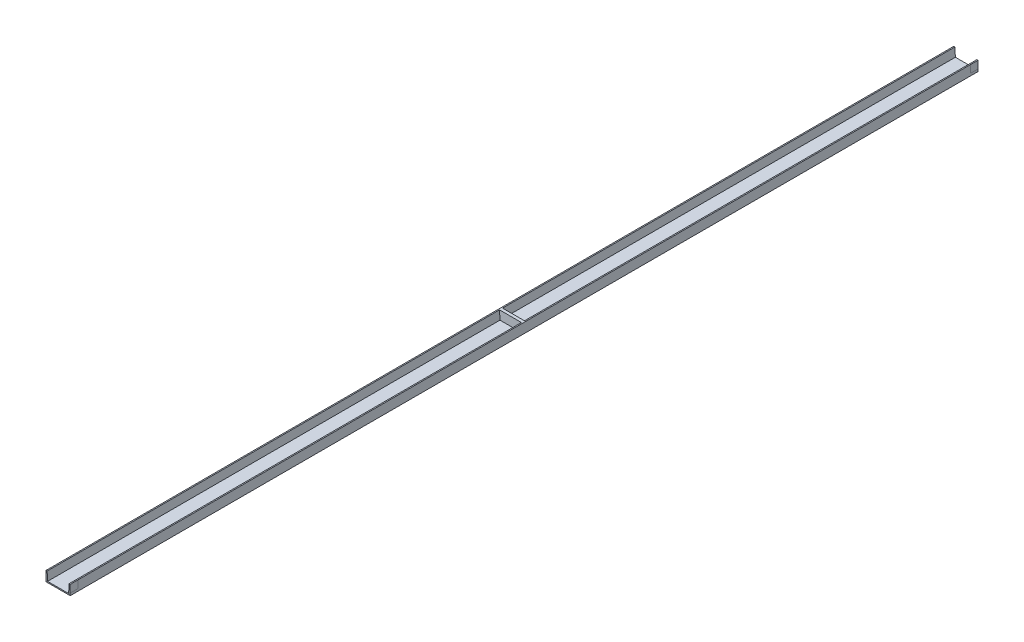
ISO-10303-21;
HEADER;
FILE_DESCRIPTION(('STEP AP214'),'2;1');
FILE_NAME('part.step','',(''),(''),'','','');
FILE_SCHEMA(('AUTOMOTIVE_DESIGN { 1 0 10303 214 1 1 1 1 }'));
ENDSEC;
DATA;
#1=APPLICATION_CONTEXT('core data for automotive mechanical design processes');
#2=APPLICATION_PROTOCOL_DEFINITION('international standard','automotive_design',2000,#1);
#3=PRODUCT_CONTEXT('',#1,'mechanical');
#4=PRODUCT('Part','Part','',(#3));
#5=PRODUCT_RELATED_PRODUCT_CATEGORY('part','',(#4));
#6=PRODUCT_DEFINITION_FORMATION('','',#4);
#7=PRODUCT_DEFINITION_CONTEXT('part definition',#1,'design');
#8=PRODUCT_DEFINITION('design','',#6,#7);
#9=PRODUCT_DEFINITION_SHAPE('','',#8);
#10=(LENGTH_UNIT() NAMED_UNIT(*) SI_UNIT(.MILLI.,.METRE.));
#11=(NAMED_UNIT(*) PLANE_ANGLE_UNIT() SI_UNIT($,.RADIAN.));
#12=(NAMED_UNIT(*) SI_UNIT($,.STERADIAN.) SOLID_ANGLE_UNIT());
#13=UNCERTAINTY_MEASURE_WITH_UNIT(LENGTH_MEASURE(1.E-05),#10,'distance_accuracy_value','');
#14=(GEOMETRIC_REPRESENTATION_CONTEXT(3) GLOBAL_UNCERTAINTY_ASSIGNED_CONTEXT((#13)) GLOBAL_UNIT_ASSIGNED_CONTEXT((#10,
#11,#12)) REPRESENTATION_CONTEXT('',''));
#15=CARTESIAN_POINT('',(0.,0.,0.));
#16=DIRECTION('',(0.,0.,1.));
#17=DIRECTION('',(1.,0.,0.));
#18=AXIS2_PLACEMENT_3D('',#15,#16,#17);
#19=CARTESIAN_POINT('',(80.,65.,3000.));
#20=DIRECTION('',(-1.,0.,0.));
#21=DIRECTION('',(0.,-1.,0.));
#22=AXIS2_PLACEMENT_3D('',#19,#20,#21);
#23=PLANE('',#22);
#24=DIRECTION('',(0.,-1.,0.));
#25=VECTOR('',#24,1.);
#26=CARTESIAN_POINT('',(80.,65.,-2950.));
#27=LINE('',#26,#25);
#28=CARTESIAN_POINT('',(80.,65.,-2950.));
#29=VERTEX_POINT('',#28);
#30=CARTESIAN_POINT('',(80.,15.,-2950.));
#31=VERTEX_POINT('',#30);
#32=EDGE_CURVE('E11',#29,#31,#27,.T.);
#33=ORIENTED_EDGE('',*,*,#32,.F.);
#34=DIRECTION('',(0.,0.,-1.));
#35=VECTOR('',#34,1.);
#36=CARTESIAN_POINT('',(80.,65.,3000.));
#37=LINE('',#36,#35);
#38=CARTESIAN_POINT('',(80.,65.,2950.));
#39=VERTEX_POINT('',#38);
#40=EDGE_CURVE('E193',#39,#29,#37,.T.);
#41=ORIENTED_EDGE('',*,*,#40,.F.);
#42=DIRECTION('',(0.,1.,0.));
#43=VECTOR('',#42,1.);
#44=CARTESIAN_POINT('',(80.,65.,2950.));
#45=LINE('',#44,#43);
#46=CARTESIAN_POINT('',(80.,15.,2950.));
#47=VERTEX_POINT('',#46);
#48=EDGE_CURVE('E199',#47,#39,#45,.T.);
#49=ORIENTED_EDGE('',*,*,#48,.F.);
#50=DIRECTION('',(0.,0.,-1.));
#51=VECTOR('',#50,1.);
#52=CARTESIAN_POINT('',(80.,15.,3000.));
#53=LINE('',#52,#51);
#54=CARTESIAN_POINT('',(80.,15.,3000.));
#55=VERTEX_POINT('',#54);
#56=EDGE_CURVE('E202',#55,#47,#53,.T.);
#57=ORIENTED_EDGE('',*,*,#56,.F.);
#58=DIRECTION('',(0.,1.,0.));
#59=VECTOR('',#58,1.);
#60=CARTESIAN_POINT('',(80.,65.,3000.));
#61=LINE('',#60,#59);
#62=CARTESIAN_POINT('',(80.,0.,3000.));
#63=VERTEX_POINT('',#62);
#64=EDGE_CURVE('E252',#63,#55,#61,.T.);
#65=ORIENTED_EDGE('',*,*,#64,.F.);
#66=DIRECTION('',(0.,0.,-1.));
#67=VECTOR('',#66,1.);
#68=CARTESIAN_POINT('',(80.,0.,3000.));
#69=LINE('',#68,#67);
#70=CARTESIAN_POINT('',(80.,0.,-3000.));
#71=VERTEX_POINT('',#70);
#72=EDGE_CURVE('E192',#63,#71,#69,.T.);
#73=ORIENTED_EDGE('',*,*,#72,.T.);
#74=DIRECTION('',(0.,1.,0.));
#75=VECTOR('',#74,1.);
#76=CARTESIAN_POINT('',(80.,65.,-3000.));
#77=LINE('',#76,#75);
#78=CARTESIAN_POINT('',(80.,15.,-3000.));
#79=VERTEX_POINT('',#78);
#80=EDGE_CURVE('E217',#71,#79,#77,.T.);
#81=ORIENTED_EDGE('',*,*,#80,.T.);
#82=DIRECTION('',(0.,0.,-1.));
#83=VECTOR('',#82,1.);
#84=CARTESIAN_POINT('',(80.,14.9999999999992,3000.));
#85=LINE('',#84,#83);
#86=EDGE_CURVE('E52',#31,#79,#85,.T.);
#87=ORIENTED_EDGE('',*,*,#86,.F.);
#88=EDGE_LOOP('',(#33,#41,#49,#57,#65,#73,#81,#87));
#89=FACE_BOUND('',#88,.T.);
#90=ADVANCED_FACE('F43',(#89),#23,.F.);
#91=CARTESIAN_POINT('',(80.,65.,-3000.));
#92=VERTEX_POINT('',#91);
#93=EDGE_CURVE('E188',#29,#92,#37,.T.);
#94=ORIENTED_EDGE('',*,*,#93,.F.);
#95=ORIENTED_EDGE('',*,*,#32,.T.);
#96=ORIENTED_EDGE('',*,*,#86,.T.);
#97=EDGE_CURVE('E210',#79,#92,#77,.T.);
#98=ORIENTED_EDGE('',*,*,#97,.T.);
#99=EDGE_LOOP('',(#94,#95,#96,#98));
#100=FACE_BOUND('',#99,.T.);
#101=ADVANCED_FACE('F209',(#100),#23,.F.);
#102=CARTESIAN_POINT('',(69.5,7.49999999999998,3000.));
#103=DIRECTION('',(0.99864171383128,-0.0521030459390228,0.));
#104=DIRECTION('',(0.0521030459390228,0.99864171383128,0.));
#105=AXIS2_PLACEMENT_3D('',#102,#103,#104);
#106=PLANE('',#105);
#107=DIRECTION('',(0.0521030459390228,0.99864171383128,0.));
#108=VECTOR('',#107,1.);
#109=CARTESIAN_POINT('',(72.5,65.,10.));
#110=LINE('',#109,#108);
#111=CARTESIAN_POINT('',(69.5,7.49999999999998,10.));
#112=VERTEX_POINT('',#111);
#113=CARTESIAN_POINT('',(72.5,65.,10.));
#114=VERTEX_POINT('',#113);
#115=EDGE_CURVE('E152',#112,#114,#110,.T.);
#116=ORIENTED_EDGE('',*,*,#115,.F.);
#117=DIRECTION('',(0.,0.,-1.));
#118=VECTOR('',#117,1.);
#119=CARTESIAN_POINT('',(69.5,7.49999999999998,3000.));
#120=LINE('',#119,#118);
#121=CARTESIAN_POINT('',(69.5,7.49999999999998,3000.));
#122=VERTEX_POINT('',#121);
#123=EDGE_CURVE('E182',#122,#112,#120,.T.);
#124=ORIENTED_EDGE('',*,*,#123,.F.);
#125=DIRECTION('',(-0.0521030459390228,-0.99864171383128,0.));
#126=VECTOR('',#125,1.);
#127=CARTESIAN_POINT('',(69.5,7.49999999999998,3000.));
#128=LINE('',#127,#126);
#129=CARTESIAN_POINT('',(72.5,65.,3000.));
#130=VERTEX_POINT('',#129);
#131=EDGE_CURVE('E257',#130,#122,#128,.T.);
#132=ORIENTED_EDGE('',*,*,#131,.F.);
#133=DIRECTION('',(0.,0.,-1.));
#134=VECTOR('',#133,1.);
#135=CARTESIAN_POINT('',(72.5,65.,3000.));
#136=LINE('',#135,#134);
#137=EDGE_CURVE('E186',#130,#114,#136,.T.);
#138=ORIENTED_EDGE('',*,*,#137,.T.);
#139=EDGE_LOOP('',(#116,#124,#132,#138));
#140=FACE_BOUND('',#139,.T.);
#141=ADVANCED_FACE('F305',(#140),#106,.F.);
#142=CARTESIAN_POINT('',(-69.5,7.49999999999998,3000.));
#143=DIRECTION('',(0.,-1.,0.));
#144=DIRECTION('',(1.,0.,0.));
#145=AXIS2_PLACEMENT_3D('',#142,#143,#144);
#146=PLANE('',#145);
#147=DIRECTION('',(1.,0.,0.));
#148=VECTOR('',#147,1.);
#149=CARTESIAN_POINT('',(69.5,7.49999999999998,10.));
#150=LINE('',#149,#148);
#151=CARTESIAN_POINT('',(-69.5,7.49999999999998,10.));
#152=VERTEX_POINT('',#151);
#153=EDGE_CURVE('E168',#152,#112,#150,.T.);
#154=ORIENTED_EDGE('',*,*,#153,.F.);
#155=DIRECTION('',(0.,0.,-1.));
#156=VECTOR('',#155,1.);
#157=CARTESIAN_POINT('',(-69.5,7.49999999999998,3000.));
#158=LINE('',#157,#156);
#159=CARTESIAN_POINT('',(-69.5,7.49999999999998,3000.));
#160=VERTEX_POINT('',#159);
#161=EDGE_CURVE('E167',#160,#152,#158,.T.);
#162=ORIENTED_EDGE('',*,*,#161,.F.);
#163=DIRECTION('',(-1.,0.,0.));
#164=VECTOR('',#163,1.);
#165=CARTESIAN_POINT('',(-69.5,7.49999999999998,3000.));
#166=LINE('',#165,#164);
#167=EDGE_CURVE('E259',#122,#160,#166,.T.);
#168=ORIENTED_EDGE('',*,*,#167,.F.);
#169=ORIENTED_EDGE('',*,*,#123,.T.);
#170=EDGE_LOOP('',(#154,#162,#168,#169));
#171=FACE_BOUND('',#170,.T.);
#172=ADVANCED_FACE('F325',(#171),#146,.F.);
#173=CARTESIAN_POINT('',(-72.5,65.,3000.));
#174=DIRECTION('',(-0.99864171383128,-0.0521030459390229,0.));
#175=DIRECTION('',(0.0521030459390229,-0.99864171383128,0.));
#176=AXIS2_PLACEMENT_3D('',#173,#174,#175);
#177=PLANE('',#176);
#178=DIRECTION('',(0.0521030459390229,-0.99864171383128,0.));
#179=VECTOR('',#178,1.);
#180=CARTESIAN_POINT('',(-69.5,7.49999999999998,10.));
#181=LINE('',#180,#179);
#182=CARTESIAN_POINT('',(-72.5,65.,10.));
#183=VERTEX_POINT('',#182);
#184=EDGE_CURVE('E149',#183,#152,#181,.T.);
#185=ORIENTED_EDGE('',*,*,#184,.F.);
#186=DIRECTION('',(0.,0.,-1.));
#187=VECTOR('',#186,1.);
#188=CARTESIAN_POINT('',(-72.5,65.,3000.));
#189=LINE('',#188,#187);
#190=CARTESIAN_POINT('',(-72.5,65.,3000.));
#191=VERTEX_POINT('',#190);
#192=EDGE_CURVE('E164',#191,#183,#189,.T.);
#193=ORIENTED_EDGE('',*,*,#192,.F.);
#194=DIRECTION('',(-0.0521030459390229,0.99864171383128,0.));
#195=VECTOR('',#194,1.);
#196=CARTESIAN_POINT('',(-72.5,65.,3000.));
#197=LINE('',#196,#195);
#198=EDGE_CURVE('E261',#160,#191,#197,.T.);
#199=ORIENTED_EDGE('',*,*,#198,.F.);
#200=ORIENTED_EDGE('',*,*,#161,.T.);
#201=EDGE_LOOP('',(#185,#193,#199,#200));
#202=FACE_BOUND('',#201,.T.);
#203=ADVANCED_FACE('F162',(#202),#177,.F.);
#204=CARTESIAN_POINT('',(-80.,0.,3000.));
#205=DIRECTION('',(1.,0.,0.));
#206=DIRECTION('',(0.,1.,0.));
#207=AXIS2_PLACEMENT_3D('',#204,#205,#206);
#208=PLANE('',#207);
#209=DIRECTION('',(0.,-1.,0.));
#210=VECTOR('',#209,1.);
#211=CARTESIAN_POINT('',(-80.,0.,-3000.));
#212=LINE('',#211,#210);
#213=CARTESIAN_POINT('',(-80.,65.,-3000.));
#214=VERTEX_POINT('',#213);
#215=CARTESIAN_POINT('',(-80.,0.,-3000.));
#216=VERTEX_POINT('',#215);
#217=EDGE_CURVE('E263',#214,#216,#212,.T.);
#218=ORIENTED_EDGE('',*,*,#217,.T.);
#219=DIRECTION('',(0.,0.,-1.));
#220=VECTOR('',#219,1.);
#221=CARTESIAN_POINT('',(-80.,0.,3000.));
#222=LINE('',#221,#220);
#223=CARTESIAN_POINT('',(-80.,0.,3000.));
#224=VERTEX_POINT('',#223);
#225=EDGE_CURVE('E196',#224,#216,#222,.T.);
#226=ORIENTED_EDGE('',*,*,#225,.F.);
#227=DIRECTION('',(0.,-1.,0.));
#228=VECTOR('',#227,1.);
#229=CARTESIAN_POINT('',(-80.,0.,3000.));
#230=LINE('',#229,#228);
#231=CARTESIAN_POINT('',(-80.,65.,3000.));
#232=VERTEX_POINT('',#231);
#233=EDGE_CURVE('E238',#232,#224,#230,.T.);
#234=ORIENTED_EDGE('',*,*,#233,.F.);
#235=DIRECTION('',(0.,0.,-1.));
#236=VECTOR('',#235,1.);
#237=CARTESIAN_POINT('',(-80.,65.,3000.));
#238=LINE('',#237,#236);
#239=EDGE_CURVE('E177',#232,#214,#238,.T.);
#240=ORIENTED_EDGE('',*,*,#239,.T.);
#241=EDGE_LOOP('',(#218,#226,#234,#240));
#242=FACE_BOUND('',#241,.T.);
#243=ADVANCED_FACE('F45',(#242),#208,.F.);
#244=CARTESIAN_POINT('',(80.,0.,3000.));
#245=DIRECTION('',(0.,1.,0.));
#246=DIRECTION('',(0.,0.,1.));
#247=AXIS2_PLACEMENT_3D('',#244,#245,#246);
#248=PLANE('',#247);
#249=DIRECTION('',(1.,0.,0.));
#250=VECTOR('',#249,1.);
#251=CARTESIAN_POINT('',(80.,0.,-3000.));
#252=LINE('',#251,#250);
#253=EDGE_CURVE('E221',#216,#71,#252,.T.);
#254=ORIENTED_EDGE('',*,*,#253,.T.);
#255=ORIENTED_EDGE('',*,*,#72,.F.);
#256=DIRECTION('',(1.,0.,0.));
#257=VECTOR('',#256,1.);
#258=CARTESIAN_POINT('',(80.,0.,3000.));
#259=LINE('',#258,#257);
#260=EDGE_CURVE('E242',#224,#63,#259,.T.);
#261=ORIENTED_EDGE('',*,*,#260,.F.);
#262=ORIENTED_EDGE('',*,*,#225,.T.);
#263=EDGE_LOOP('',(#254,#255,#261,#262));
#264=FACE_BOUND('',#263,.T.);
#265=ADVANCED_FACE('F308',(#264),#248,.F.);
#266=CARTESIAN_POINT('',(80.,65.,3000.));
#267=VERTEX_POINT('',#266);
#268=EDGE_CURVE('E247',#55,#267,#61,.T.);
#269=ORIENTED_EDGE('',*,*,#268,.F.);
#270=ORIENTED_EDGE('',*,*,#56,.T.);
#271=ORIENTED_EDGE('',*,*,#48,.T.);
#272=EDGE_CURVE('E189',#267,#39,#37,.T.);
#273=ORIENTED_EDGE('',*,*,#272,.F.);
#274=EDGE_LOOP('',(#269,#270,#271,#273));
#275=FACE_BOUND('',#274,.T.);
#276=ADVANCED_FACE('F301',(#275),#23,.F.);
#277=CARTESIAN_POINT('',(69.5,7.49999999999998,-10.));
#278=VERTEX_POINT('',#277);
#279=CARTESIAN_POINT('',(69.5,7.49999999999998,-3000.));
#280=VERTEX_POINT('',#279);
#281=EDGE_CURVE('E181',#278,#280,#120,.T.);
#282=ORIENTED_EDGE('',*,*,#281,.F.);
#283=DIRECTION('',(0.0521030459390228,0.99864171383128,0.));
#284=VECTOR('',#283,1.);
#285=CARTESIAN_POINT('',(72.5,65.,-10.));
#286=LINE('',#285,#284);
#287=CARTESIAN_POINT('',(72.5,65.,-10.));
#288=VERTEX_POINT('',#287);
#289=EDGE_CURVE('E157',#278,#288,#286,.T.);
#290=ORIENTED_EDGE('',*,*,#289,.T.);
#291=CARTESIAN_POINT('',(72.5,65.,-3000.));
#292=VERTEX_POINT('',#291);
#293=EDGE_CURVE('E185',#288,#292,#136,.T.);
#294=ORIENTED_EDGE('',*,*,#293,.T.);
#295=DIRECTION('',(-0.0521030459390228,-0.99864171383128,0.));
#296=VECTOR('',#295,1.);
#297=CARTESIAN_POINT('',(69.5,7.49999999999998,-3000.));
#298=LINE('',#297,#296);
#299=EDGE_CURVE('E225',#292,#280,#298,.T.);
#300=ORIENTED_EDGE('',*,*,#299,.T.);
#301=EDGE_LOOP('',(#282,#290,#294,#300));
#302=FACE_BOUND('',#301,.T.);
#303=ADVANCED_FACE('F281',(#302),#106,.F.);
#304=CARTESIAN_POINT('',(-69.5,7.49999999999998,-10.));
#305=VERTEX_POINT('',#304);
#306=CARTESIAN_POINT('',(-69.5,7.49999999999998,-3000.));
#307=VERTEX_POINT('',#306);
#308=EDGE_CURVE('E173',#305,#307,#158,.T.);
#309=ORIENTED_EDGE('',*,*,#308,.F.);
#310=DIRECTION('',(1.,0.,0.));
#311=VECTOR('',#310,1.);
#312=CARTESIAN_POINT('',(69.5,7.49999999999998,-10.));
#313=LINE('',#312,#311);
#314=EDGE_CURVE('E273',#305,#278,#313,.T.);
#315=ORIENTED_EDGE('',*,*,#314,.T.);
#316=ORIENTED_EDGE('',*,*,#281,.T.);
#317=DIRECTION('',(-1.,0.,0.));
#318=VECTOR('',#317,1.);
#319=CARTESIAN_POINT('',(-69.5,7.49999999999998,-3000.));
#320=LINE('',#319,#318);
#321=EDGE_CURVE('E232',#280,#307,#320,.T.);
#322=ORIENTED_EDGE('',*,*,#321,.T.);
#323=EDGE_LOOP('',(#309,#315,#316,#322));
#324=FACE_BOUND('',#323,.T.);
#325=ADVANCED_FACE('F287',(#324),#146,.F.);
#326=CARTESIAN_POINT('',(-72.5,65.,-9.99999999999979));
#327=VERTEX_POINT('',#326);
#328=CARTESIAN_POINT('',(-72.5,65.,-3000.));
#329=VERTEX_POINT('',#328);
#330=EDGE_CURVE('E174',#327,#329,#189,.T.);
#331=ORIENTED_EDGE('',*,*,#330,.F.);
#332=DIRECTION('',(0.0521030459390229,-0.99864171383128,0.));
#333=VECTOR('',#332,1.);
#334=CARTESIAN_POINT('',(-69.5,7.49999999999998,-10.));
#335=LINE('',#334,#333);
#336=EDGE_CURVE('E271',#327,#305,#335,.T.);
#337=ORIENTED_EDGE('',*,*,#336,.T.);
#338=ORIENTED_EDGE('',*,*,#308,.T.);
#339=DIRECTION('',(-0.0521030459390229,0.99864171383128,0.));
#340=VECTOR('',#339,1.);
#341=CARTESIAN_POINT('',(-72.5,65.,-3000.));
#342=LINE('',#341,#340);
#343=EDGE_CURVE('E235',#307,#329,#342,.T.);
#344=ORIENTED_EDGE('',*,*,#343,.T.);
#345=EDGE_LOOP('',(#331,#337,#338,#344));
#346=FACE_BOUND('',#345,.T.);
#347=ADVANCED_FACE('F290',(#346),#177,.F.);
#348=CARTESIAN_POINT('',(-80.,65.,3000.));
#349=DIRECTION('',(0.,-1.,0.));
#350=DIRECTION('',(1.,0.,0.));
#351=AXIS2_PLACEMENT_3D('',#348,#349,#350);
#352=PLANE('',#351);
#353=DIRECTION('',(-1.,0.,0.));
#354=VECTOR('',#353,1.);
#355=CARTESIAN_POINT('',(-80.,65.,-3000.));
#356=LINE('',#355,#354);
#357=EDGE_CURVE('E237',#329,#214,#356,.T.);
#358=ORIENTED_EDGE('',*,*,#357,.T.);
#359=ORIENTED_EDGE('',*,*,#239,.F.);
#360=DIRECTION('',(-1.,0.,0.));
#361=VECTOR('',#360,1.);
#362=CARTESIAN_POINT('',(-80.,65.,3000.));
#363=LINE('',#362,#361);
#364=EDGE_CURVE('E172',#191,#232,#363,.T.);
#365=ORIENTED_EDGE('',*,*,#364,.F.);
#366=ORIENTED_EDGE('',*,*,#192,.T.);
#367=DIRECTION('',(-1.,0.,0.));
#368=VECTOR('',#367,1.);
#369=CARTESIAN_POINT('',(-72.5,65.,10.));
#370=LINE('',#369,#368);
#371=EDGE_CURVE('E146',#114,#183,#370,.T.);
#372=ORIENTED_EDGE('',*,*,#371,.F.);
#373=ORIENTED_EDGE('',*,*,#137,.F.);
#374=DIRECTION('',(-1.,0.,0.));
#375=VECTOR('',#374,1.);
#376=CARTESIAN_POINT('',(72.5,65.,3000.));
#377=LINE('',#376,#375);
#378=EDGE_CURVE('E255',#267,#130,#377,.T.);
#379=ORIENTED_EDGE('',*,*,#378,.F.);
#380=ORIENTED_EDGE('',*,*,#272,.T.);
#381=ORIENTED_EDGE('',*,*,#40,.T.);
#382=ORIENTED_EDGE('',*,*,#93,.T.);
#383=DIRECTION('',(-1.,0.,0.));
#384=VECTOR('',#383,1.);
#385=CARTESIAN_POINT('',(72.5,65.,-3000.));
#386=LINE('',#385,#384);
#387=EDGE_CURVE('E220',#92,#292,#386,.T.);
#388=ORIENTED_EDGE('',*,*,#387,.T.);
#389=ORIENTED_EDGE('',*,*,#293,.F.);
#390=DIRECTION('',(-1.,0.,0.));
#391=VECTOR('',#390,1.);
#392=CARTESIAN_POINT('',(-72.5,65.,-10.));
#393=LINE('',#392,#391);
#394=EDGE_CURVE('E269',#288,#327,#393,.T.);
#395=ORIENTED_EDGE('',*,*,#394,.T.);
#396=ORIENTED_EDGE('',*,*,#330,.T.);
#397=EDGE_LOOP('',(#358,#359,#365,#366,#372,#373,#379,#380,#381,#382,#388,#389,#395,#396));
#398=FACE_BOUND('',#397,.T.);
#399=ADVANCED_FACE('F170',(#398),#352,.F.);
#400=CARTESIAN_POINT('',(0.,0.,3000.));
#401=DIRECTION('',(0.,0.,-1.));
#402=DIRECTION('',(-1.,0.,0.));
#403=AXIS2_PLACEMENT_3D('',#400,#401,#402);
#404=PLANE('',#403);
#405=ORIENTED_EDGE('',*,*,#233,.T.);
#406=ORIENTED_EDGE('',*,*,#260,.T.);
#407=ORIENTED_EDGE('',*,*,#64,.T.);
#408=ORIENTED_EDGE('',*,*,#268,.T.);
#409=ORIENTED_EDGE('',*,*,#378,.T.);
#410=ORIENTED_EDGE('',*,*,#131,.T.);
#411=ORIENTED_EDGE('',*,*,#167,.T.);
#412=ORIENTED_EDGE('',*,*,#198,.T.);
#413=ORIENTED_EDGE('',*,*,#364,.T.);
#414=EDGE_LOOP('',(#405,#406,#407,#408,#409,#410,#411,#412,#413));
#415=FACE_BOUND('',#414,.T.);
#416=ADVANCED_FACE('F319',(#415),#404,.F.);
#417=CARTESIAN_POINT('',(0.,0.,-3000.));
#418=DIRECTION('',(0.,0.,-1.));
#419=DIRECTION('',(-1.,0.,0.));
#420=AXIS2_PLACEMENT_3D('',#417,#418,#419);
#421=PLANE('',#420);
#422=ORIENTED_EDGE('',*,*,#217,.F.);
#423=ORIENTED_EDGE('',*,*,#357,.F.);
#424=ORIENTED_EDGE('',*,*,#343,.F.);
#425=ORIENTED_EDGE('',*,*,#321,.F.);
#426=ORIENTED_EDGE('',*,*,#299,.F.);
#427=ORIENTED_EDGE('',*,*,#387,.F.);
#428=ORIENTED_EDGE('',*,*,#97,.F.);
#429=ORIENTED_EDGE('',*,*,#80,.F.);
#430=ORIENTED_EDGE('',*,*,#253,.F.);
#431=EDGE_LOOP('',(#422,#423,#424,#425,#426,#427,#428,#429,#430));
#432=FACE_BOUND('',#431,.T.);
#433=ADVANCED_FACE('F216',(#432),#421,.T.);
#434=CARTESIAN_POINT('',(0.,0.,10.));
#435=DIRECTION('',(0.,0.,-1.));
#436=DIRECTION('',(-1.,0.,0.));
#437=AXIS2_PLACEMENT_3D('',#434,#435,#436);
#438=PLANE('',#437);
#439=ORIENTED_EDGE('',*,*,#371,.T.);
#440=ORIENTED_EDGE('',*,*,#184,.T.);
#441=ORIENTED_EDGE('',*,*,#153,.T.);
#442=ORIENTED_EDGE('',*,*,#115,.T.);
#443=EDGE_LOOP('',(#439,#440,#441,#442));
#444=FACE_BOUND('',#443,.T.);
#445=ADVANCED_FACE('F148',(#444),#438,.F.);
#446=CARTESIAN_POINT('',(0.,0.,-10.));
#447=DIRECTION('',(0.,0.,-1.));
#448=DIRECTION('',(-1.,0.,0.));
#449=AXIS2_PLACEMENT_3D('',#446,#447,#448);
#450=PLANE('',#449);
#451=ORIENTED_EDGE('',*,*,#394,.F.);
#452=ORIENTED_EDGE('',*,*,#289,.F.);
#453=ORIENTED_EDGE('',*,*,#314,.F.);
#454=ORIENTED_EDGE('',*,*,#336,.F.);
#455=EDGE_LOOP('',(#451,#452,#453,#454));
#456=FACE_BOUND('',#455,.T.);
#457=ADVANCED_FACE('F291',(#456),#450,.T.);
#458=CLOSED_SHELL('',(#90,#101,#141,#172,#203,#243,#265,#276,#303,#325,#347,#399,#416,#433,#445,#457));
#459=MANIFOLD_SOLID_BREP('B2',#458);
#460=ADVANCED_BREP_SHAPE_REPRESENTATION('',(#18,#459),#14);
#461=SHAPE_DEFINITION_REPRESENTATION(#9,#460);
ENDSEC;
END-ISO-10303-21;
